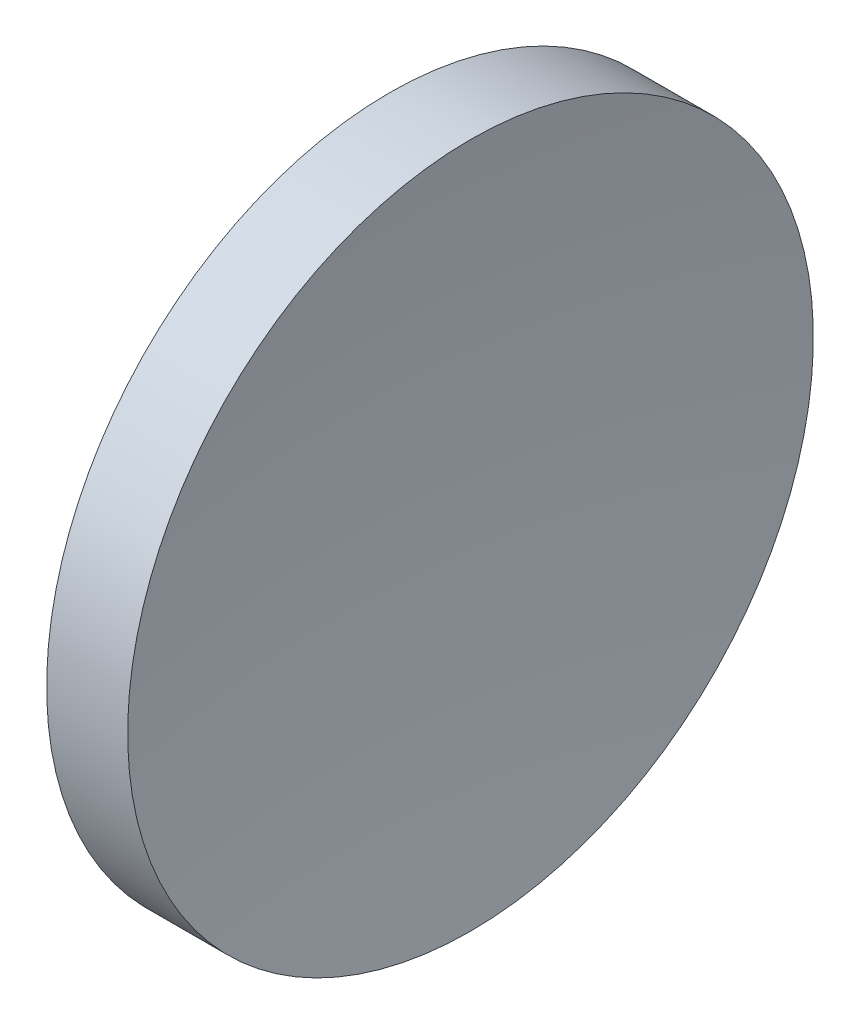
ISO-10303-21;
HEADER;
FILE_DESCRIPTION(('STEP AP214'),'2;1');
FILE_NAME('part.step','',(''),(''),'','','');
FILE_SCHEMA(('AUTOMOTIVE_DESIGN { 1 0 10303 214 1 1 1 1 }'));
ENDSEC;
DATA;
#1=APPLICATION_CONTEXT('core data for automotive mechanical design processes');
#2=APPLICATION_PROTOCOL_DEFINITION('international standard','automotive_design',2000,#1);
#3=PRODUCT_CONTEXT('',#1,'mechanical');
#4=PRODUCT('Part','Part','',(#3));
#5=PRODUCT_RELATED_PRODUCT_CATEGORY('part','',(#4));
#6=PRODUCT_DEFINITION_FORMATION('','',#4);
#7=PRODUCT_DEFINITION_CONTEXT('part definition',#1,'design');
#8=PRODUCT_DEFINITION('design','',#6,#7);
#9=PRODUCT_DEFINITION_SHAPE('','',#8);
#10=(LENGTH_UNIT() NAMED_UNIT(*) SI_UNIT(.MILLI.,.METRE.));
#11=(NAMED_UNIT(*) PLANE_ANGLE_UNIT() SI_UNIT($,.RADIAN.));
#12=(NAMED_UNIT(*) SI_UNIT($,.STERADIAN.) SOLID_ANGLE_UNIT());
#13=UNCERTAINTY_MEASURE_WITH_UNIT(LENGTH_MEASURE(1.E-05),#10,'distance_accuracy_value','');
#14=(GEOMETRIC_REPRESENTATION_CONTEXT(3) GLOBAL_UNCERTAINTY_ASSIGNED_CONTEXT((#13)) GLOBAL_UNIT_ASSIGNED_CONTEXT((#10,
#11,#12)) REPRESENTATION_CONTEXT('',''));
#15=CARTESIAN_POINT('',(0.,0.,0.));
#16=DIRECTION('',(0.,0.,1.));
#17=DIRECTION('',(1.,0.,0.));
#18=AXIS2_PLACEMENT_3D('',#15,#16,#17);
#19=CARTESIAN_POINT('',(141.978188248667,32.5964882789391,0.));
#20=DIRECTION('',(0.,0.,-1.));
#21=DIRECTION('',(0.,-1.,0.));
#22=AXIS2_PLACEMENT_3D('',#19,#20,#21);
#23=CIRCLE('',#22,82.62);
#24=TRIMMED_CURVE('',#23,(PARAMETER_VALUE(-1.57058133810229)),
(PARAMETER_VALUE(1.57058133810229)),.T.,.PARAMETER.);
#25=CARTESIAN_POINT('',(141.978188248667,32.578725913293,0.));
#26=DIRECTION('',(-1.,0.,0.));
#27=AXIS1_PLACEMENT('',#25,#26);
#28=SURFACE_OF_REVOLUTION('',#24,#27);
#29=CARTESIAN_POINT('',(60.3119772103362,32.5787259132931,0.));
#30=DIRECTION('',(-1.,0.,0.));
#31=DIRECTION('',(0.,-1.,0.));
#32=AXIS2_PLACEMENT_3D('',#29,#30,#31);
#33=CIRCLE('',#32,12.5);
#34=CARTESIAN_POINT('',(60.3119772103362,20.0787259132931,0.));
#35=VERTEX_POINT('',#34);
#36=EDGE_CURVE('E11',#35,#35,#33,.T.);
#37=ORIENTED_EDGE('',*,*,#36,.F.);
#38=EDGE_LOOP('',(#37));
#39=FACE_BOUND('',#38,.T.);
#40=CARTESIAN_POINT('',(59.3581901580211,32.5787259132931,0.));
#41=VERTEX_POINT('',#40);
#42=VERTEX_LOOP('',#41);
#43=FACE_BOUND('',#42,.T.);
#44=ADVANCED_FACE('F37',(#39,#43),#28,.F.);
#45=CARTESIAN_POINT('',(55.0073946244212,32.5787259132931,0.));
#46=DIRECTION('',(-1.,0.,0.));
#47=DIRECTION('',(0.,-1.,0.));
#48=AXIS2_PLACEMENT_3D('',#45,#46,#47);
#49=CYLINDRICAL_SURFACE('',#48,12.5);
#50=CARTESIAN_POINT('',(57.3581901580211,32.5787259132931,0.));
#51=DIRECTION('',(-1.,0.,0.));
#52=DIRECTION('',(0.,-1.,0.));
#53=AXIS2_PLACEMENT_3D('',#50,#51,#52);
#54=CIRCLE('',#53,12.5);
#55=CARTESIAN_POINT('',(57.3581901580211,20.0787259132931,0.));
#56=VERTEX_POINT('',#55);
#57=EDGE_CURVE('E43',#56,#56,#54,.T.);
#58=ORIENTED_EDGE('',*,*,#57,.F.);
#59=EDGE_LOOP('',(#58));
#60=FACE_BOUND('',#59,.T.);
#61=ORIENTED_EDGE('',*,*,#36,.T.);
#62=EDGE_LOOP('',(#61));
#63=FACE_BOUND('',#62,.T.);
#64=ADVANCED_FACE('F47',(#60,#63),#49,.T.);
#65=CARTESIAN_POINT('',(57.3581901580211,32.5787259132931,0.));
#66=DIRECTION('',(1.,0.,0.));
#67=DIRECTION('',(0.,1.,0.));
#68=AXIS2_PLACEMENT_3D('',#65,#66,#67);
#69=PLANE('',#68);
#70=ORIENTED_EDGE('',*,*,#57,.T.);
#71=EDGE_LOOP('',(#70));
#72=FACE_BOUND('',#71,.T.);
#73=ADVANCED_FACE('F52',(#72),#69,.F.);
#74=CLOSED_SHELL('',(#44,#64,#73));
#75=MANIFOLD_SOLID_BREP('B2',#74);
#76=ADVANCED_BREP_SHAPE_REPRESENTATION('',(#18,#75),#14);
#77=SHAPE_DEFINITION_REPRESENTATION(#9,#76);
ENDSEC;
END-ISO-10303-21;
